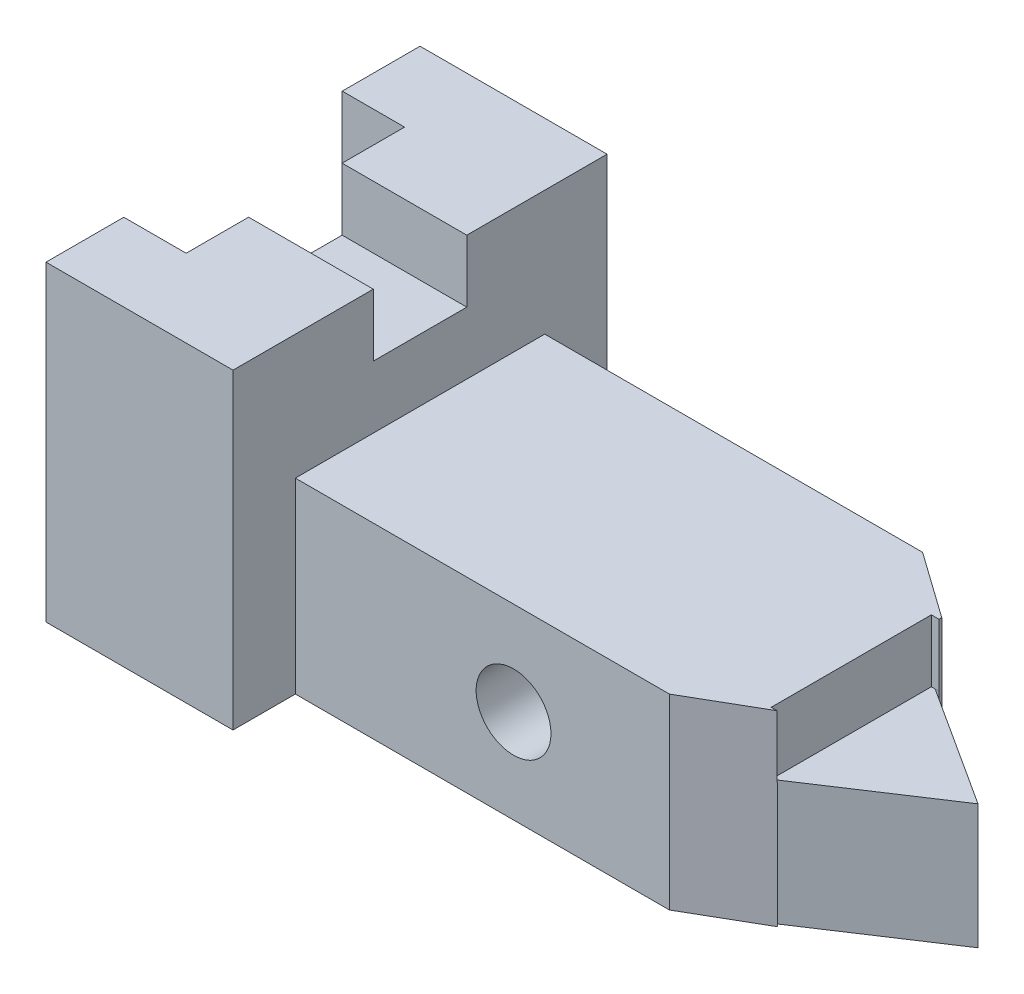
ISO-10303-21;
HEADER;
FILE_DESCRIPTION(('STEP AP214'),'2;1');
FILE_NAME('part.step','',(''),(''),'','','');
FILE_SCHEMA(('AUTOMOTIVE_DESIGN { 1 0 10303 214 1 1 1 1 }'));
ENDSEC;
DATA;
#1=APPLICATION_CONTEXT('core data for automotive mechanical design processes');
#2=APPLICATION_PROTOCOL_DEFINITION('international standard','automotive_design',2000,#1);
#3=PRODUCT_CONTEXT('',#1,'mechanical');
#4=PRODUCT('Part','Part','',(#3));
#5=PRODUCT_RELATED_PRODUCT_CATEGORY('part','',(#4));
#6=PRODUCT_DEFINITION_FORMATION('','',#4);
#7=PRODUCT_DEFINITION_CONTEXT('part definition',#1,'design');
#8=PRODUCT_DEFINITION('design','',#6,#7);
#9=PRODUCT_DEFINITION_SHAPE('','',#8);
#10=(LENGTH_UNIT() NAMED_UNIT(*) SI_UNIT(.MILLI.,.METRE.));
#11=(NAMED_UNIT(*) PLANE_ANGLE_UNIT() SI_UNIT($,.RADIAN.));
#12=(NAMED_UNIT(*) SI_UNIT($,.STERADIAN.) SOLID_ANGLE_UNIT());
#13=UNCERTAINTY_MEASURE_WITH_UNIT(LENGTH_MEASURE(1.E-05),#10,'distance_accuracy_value','');
#14=(GEOMETRIC_REPRESENTATION_CONTEXT(3) GLOBAL_UNCERTAINTY_ASSIGNED_CONTEXT((#13)) GLOBAL_UNIT_ASSIGNED_CONTEXT((#10,
#11,#12)) REPRESENTATION_CONTEXT('',''));
#15=CARTESIAN_POINT('',(0.,0.,0.));
#16=DIRECTION('',(0.,0.,1.));
#17=DIRECTION('',(1.,0.,0.));
#18=AXIS2_PLACEMENT_3D('',#15,#16,#17);
#19=CARTESIAN_POINT('',(-21.8340611353712,-16.8122270742358,-60.));
#20=DIRECTION('',(-1.,0.,0.));
#21=DIRECTION('',(0.,0.,1.));
#22=AXIS2_PLACEMENT_3D('',#19,#20,#21);
#23=PLANE('',#22);
#24=DIRECTION('',(0.,1.,0.));
#25=VECTOR('',#24,1.);
#26=CARTESIAN_POINT('',(-21.8340611353712,-36.8122270742358,-12.4803423104678));
#27=LINE('',#26,#25);
#28=CARTESIAN_POINT('',(-21.8340611353712,-16.8122270742358,-12.4803423104678));
#29=VERTEX_POINT('',#28);
#30=CARTESIAN_POINT('',(-21.8340611353712,33.1877729257642,-12.4803423104678));
#31=VERTEX_POINT('',#30);
#32=EDGE_CURVE('E230',#29,#31,#27,.T.);
#33=ORIENTED_EDGE('',*,*,#32,.F.);
#34=DIRECTION('',(0.,0.,1.));
#35=VECTOR('',#34,1.);
#36=CARTESIAN_POINT('',(-21.8340611353712,-16.8122270742358,-60.));
#37=LINE('',#36,#35);
#38=CARTESIAN_POINT('',(-21.8340611353712,-16.8122270742358,0.));
#39=VERTEX_POINT('',#38);
#40=EDGE_CURVE('E448',#29,#39,#37,.T.);
#41=ORIENTED_EDGE('',*,*,#40,.T.);
#42=DIRECTION('',(0.,-1.,0.));
#43=VECTOR('',#42,1.);
#44=CARTESIAN_POINT('',(-21.8340611353712,-16.8122270742358,0.));
#45=LINE('',#44,#43);
#46=CARTESIAN_POINT('',(-21.8340611353712,33.1877729257642,0.));
#47=VERTEX_POINT('',#46);
#48=EDGE_CURVE('E430',#47,#39,#45,.T.);
#49=ORIENTED_EDGE('',*,*,#48,.F.);
#50=DIRECTION('',(0.,0.,1.));
#51=VECTOR('',#50,1.);
#52=CARTESIAN_POINT('',(-21.8340611353712,33.1877729257642,-60.));
#53=LINE('',#52,#51);
#54=EDGE_CURVE('E468',#31,#47,#53,.T.);
#55=ORIENTED_EDGE('',*,*,#54,.F.);
#56=EDGE_LOOP('',(#33,#41,#49,#55));
#57=FACE_BOUND('',#56,.T.);
#58=ADVANCED_FACE('F39',(#57),#23,.T.);
#59=CARTESIAN_POINT('',(-21.8340611353712,33.1877729257642,-60.));
#60=DIRECTION('',(0.,1.,0.));
#61=DIRECTION('',(-1.,0.,0.));
#62=AXIS2_PLACEMENT_3D('',#59,#60,#61);
#63=PLANE('',#62);
#64=DIRECTION('',(1.,0.,0.));
#65=VECTOR('',#64,1.);
#66=CARTESIAN_POINT('',(-11.8340611353712,33.1877729257642,-12.4803423104678));
#67=LINE('',#66,#65);
#68=CARTESIAN_POINT('',(-11.8340611353712,33.1877729257642,-12.4803423104678));
#69=VERTEX_POINT('',#68);
#70=EDGE_CURVE('E227',#31,#69,#67,.T.);
#71=ORIENTED_EDGE('',*,*,#70,.F.);
#72=ORIENTED_EDGE('',*,*,#54,.T.);
#73=DIRECTION('',(-1.,0.,0.));
#74=VECTOR('',#73,1.);
#75=CARTESIAN_POINT('',(-21.8340611353712,33.1877729257642,0.));
#76=LINE('',#75,#74);
#77=CARTESIAN_POINT('',(8.16593886462882,33.1877729257642,0.));
#78=VERTEX_POINT('',#77);
#79=EDGE_CURVE('E436',#78,#47,#76,.T.);
#80=ORIENTED_EDGE('',*,*,#79,.F.);
#81=DIRECTION('',(0.,0.,1.));
#82=VECTOR('',#81,1.);
#83=CARTESIAN_POINT('',(8.16593886462882,33.1877729257642,-60.));
#84=LINE('',#83,#82);
#85=CARTESIAN_POINT('',(8.16593886462882,33.1877729257642,-22.5));
#86=VERTEX_POINT('',#85);
#87=EDGE_CURVE('E473',#86,#78,#84,.T.);
#88=ORIENTED_EDGE('',*,*,#87,.F.);
#89=DIRECTION('',(-1.,0.,0.));
#90=VECTOR('',#89,1.);
#91=CARTESIAN_POINT('',(0.,33.1877729257642,-22.5));
#92=LINE('',#91,#90);
#93=CARTESIAN_POINT('',(-11.8340611353712,33.1877729257642,-22.5));
#94=VERTEX_POINT('',#93);
#95=EDGE_CURVE('E239',#86,#94,#92,.T.);
#96=ORIENTED_EDGE('',*,*,#95,.T.);
#97=DIRECTION('',(0.,0.,-1.));
#98=VECTOR('',#97,1.);
#99=CARTESIAN_POINT('',(-11.8340611353712,33.1877729257642,-47.5196576895322));
#100=LINE('',#99,#98);
#101=EDGE_CURVE('E215',#69,#94,#100,.T.);
#102=ORIENTED_EDGE('',*,*,#101,.F.);
#103=EDGE_LOOP('',(#71,#72,#80,#88,#96,#102));
#104=FACE_BOUND('',#103,.T.);
#105=ADVANCED_FACE('F237',(#104),#63,.T.);
#106=CARTESIAN_POINT('',(78.1659388646288,3.18777292576419,-16.3243930873946));
#107=DIRECTION('',(0.,-1.,0.));
#108=DIRECTION('',(0.,0.,-1.));
#109=AXIS2_PLACEMENT_3D('',#106,#107,#108);
#110=PLANE('',#109);
#111=DIRECTION('',(0.999999826050975,0.,0.000589828805581013));
#112=VECTOR('',#111,1.);
#113=CARTESIAN_POINT('',(0.0248069572609484,3.18777292576419,-42.0578864766806));
#114=LINE('',#113,#112);
#115=CARTESIAN_POINT('',(78.7775995276505,3.18777292576419,-42.0114358030226));
#116=VERTEX_POINT('',#115);
#117=CARTESIAN_POINT('',(79.389260190672,3.18777292576419,-42.0110750278815));
#118=VERTEX_POINT('',#117);
#119=EDGE_CURVE('E285',#116,#118,#114,.T.);
#120=ORIENTED_EDGE('',*,*,#119,.T.);
#121=DIRECTION('',(0.,0.,-1.));
#122=VECTOR('',#121,1.);
#123=CARTESIAN_POINT('',(79.389260190672,3.18777292576419,-16.3243930873946));
#124=LINE('',#123,#122);
#125=CARTESIAN_POINT('',(79.389260190672,3.18777292576419,-42.0114358030226));
#126=VERTEX_POINT('',#125);
#127=EDGE_CURVE('E339',#118,#126,#124,.T.);
#128=ORIENTED_EDGE('',*,*,#127,.T.);
#129=DIRECTION('',(1.,0.,0.));
#130=VECTOR('',#129,1.);
#131=CARTESIAN_POINT('',(78.1659388646288,3.18777292576419,-42.0114358030226));
#132=LINE('',#131,#130);
#133=EDGE_CURVE('E374',#116,#126,#132,.T.);
#134=ORIENTED_EDGE('',*,*,#133,.F.);
#135=EDGE_LOOP('',(#120,#128,#134));
#136=FACE_BOUND('',#135,.T.);
#137=ADVANCED_FACE('F512',(#136),#110,.F.);
#138=CARTESIAN_POINT('',(-21.8340611353712,-16.8122270742358,-60.));
#139=DIRECTION('',(0.,-1.,0.));
#140=DIRECTION('',(0.,0.,-1.));
#141=AXIS2_PLACEMENT_3D('',#138,#139,#140);
#142=PLANE('',#141);
#143=DIRECTION('',(-1.,0.,0.));
#144=VECTOR('',#143,1.);
#145=CARTESIAN_POINT('',(-21.8340611353712,-16.8122270742358,-12.4803423104678));
#146=LINE('',#145,#144);
#147=CARTESIAN_POINT('',(-11.8340611353712,-16.8122270742358,-12.4803423104678));
#148=VERTEX_POINT('',#147);
#149=EDGE_CURVE('E260',#148,#29,#146,.T.);
#150=ORIENTED_EDGE('',*,*,#149,.F.);
#151=DIRECTION('',(0.,0.,1.));
#152=VECTOR('',#151,1.);
#153=CARTESIAN_POINT('',(-11.8340611353712,-16.8122270742358,-60.));
#154=LINE('',#153,#152);
#155=CARTESIAN_POINT('',(-11.8340611353712,-16.8122270742358,-47.5196576895322));
#156=VERTEX_POINT('',#155);
#157=EDGE_CURVE('E219',#156,#148,#154,.T.);
#158=ORIENTED_EDGE('',*,*,#157,.F.);
#159=DIRECTION('',(1.,0.,0.));
#160=VECTOR('',#159,1.);
#161=CARTESIAN_POINT('',(-21.8340611353712,-16.8122270742358,-47.5196576895322));
#162=LINE('',#161,#160);
#163=CARTESIAN_POINT('',(-21.8340611353712,-16.8122270742358,-47.5196576895322));
#164=VERTEX_POINT('',#163);
#165=EDGE_CURVE('E257',#164,#156,#162,.T.);
#166=ORIENTED_EDGE('',*,*,#165,.F.);
#167=CARTESIAN_POINT('',(-21.8340611353712,-16.8122270742358,-60.));
#168=VERTEX_POINT('',#167);
#169=EDGE_CURVE('E479',#168,#164,#37,.T.);
#170=ORIENTED_EDGE('',*,*,#169,.F.);
#171=DIRECTION('',(1.,0.,0.));
#172=VECTOR('',#171,1.);
#173=CARTESIAN_POINT('',(-21.8340611353712,-16.8122270742358,-60.));
#174=LINE('',#173,#172);
#175=CARTESIAN_POINT('',(8.16593886462882,-16.8122270742358,-60.));
#176=VERTEX_POINT('',#175);
#177=EDGE_CURVE('E435',#168,#176,#174,.T.);
#178=ORIENTED_EDGE('',*,*,#177,.T.);
#179=DIRECTION('',(0.,0.,1.));
#180=VECTOR('',#179,1.);
#181=CARTESIAN_POINT('',(8.16593886462882,-16.8122270742358,-60.));
#182=LINE('',#181,#180);
#183=CARTESIAN_POINT('',(8.16593886462882,-16.8122270742358,-50.));
#184=VERTEX_POINT('',#183);
#185=EDGE_CURVE('E474',#176,#184,#182,.T.);
#186=ORIENTED_EDGE('',*,*,#185,.T.);
#187=DIRECTION('',(-1.,0.,0.));
#188=VECTOR('',#187,1.);
#189=CARTESIAN_POINT('',(98.1659388646288,-16.8122270742358,-50.));
#190=LINE('',#189,#188);
#191=CARTESIAN_POINT('',(68.7775995276504,-16.8122270742358,-50.));
#192=VERTEX_POINT('',#191);
#193=EDGE_CURVE('E424',#192,#184,#190,.T.);
#194=ORIENTED_EDGE('',*,*,#193,.F.);
#195=DIRECTION('',(-0.815286839488451,0.,-0.579057310943341));
#196=VECTOR('',#195,1.);
#197=CARTESIAN_POINT('',(3.8277183853929,-16.8122270742358,-96.1306397928897));
#198=LINE('',#197,#196);
#199=CARTESIAN_POINT('',(79.389260190672,-16.8122270742358,-42.463070185178));
#200=VERTEX_POINT('',#199);
#201=EDGE_CURVE('E398',#200,#192,#198,.T.);
#202=ORIENTED_EDGE('',*,*,#201,.F.);
#203=DIRECTION('',(0.,0.,-1.));
#204=VECTOR('',#203,1.);
#205=CARTESIAN_POINT('',(79.389260190672,-16.8122270742358,-42.));
#206=LINE('',#205,#204);
#207=CARTESIAN_POINT('',(79.389260190672,-16.8122270742358,-42.0110750278815));
#208=VERTEX_POINT('',#207);
#209=EDGE_CURVE('E336',#208,#200,#206,.T.);
#210=ORIENTED_EDGE('',*,*,#209,.F.);
#211=DIRECTION('',(-0.999999826050975,0.,-0.000589828805581013));
#212=VECTOR('',#211,1.);
#213=CARTESIAN_POINT('',(-21.8446363042624,-16.8122270742358,-42.0707857065221));
#214=LINE('',#213,#212);
#215=CARTESIAN_POINT('',(78.7775995276505,-16.8122270742358,-42.0114358030226));
#216=VERTEX_POINT('',#215);
#217=EDGE_CURVE('E307',#208,#216,#214,.T.);
#218=ORIENTED_EDGE('',*,*,#217,.T.);
#219=DIRECTION('',(-0.840240777547195,0.,-0.542213459577393));
#220=VECTOR('',#219,1.);
#221=CARTESIAN_POINT('',(-0.450099541336825,-16.8122270742358,-93.1376438549036));
#222=LINE('',#221,#220);
#223=CARTESIAN_POINT('',(98.1659388646288,-16.8122270742358,-29.5));
#224=VERTEX_POINT('',#223);
#225=EDGE_CURVE('E304',#224,#216,#222,.T.);
#226=ORIENTED_EDGE('',*,*,#225,.F.);
#227=DIRECTION('',(0.835077350902561,0.,-0.550132545855598));
#228=VECTOR('',#227,1.);
#229=CARTESIAN_POINT('',(28.4952355114466,-16.8122270742358,16.3976900353133));
#230=LINE('',#229,#228);
#231=CARTESIAN_POINT('',(78.1659388646288,-16.8122270742358,-16.3243930873946));
#232=VERTEX_POINT('',#231);
#233=EDGE_CURVE('E332',#232,#224,#230,.T.);
#234=ORIENTED_EDGE('',*,*,#233,.F.);
#235=DIRECTION('',(-0.999429931961685,0.,0.033761088534901));
#236=VECTOR('',#235,1.);
#237=CARTESIAN_POINT('',(-20.2463845795361,-16.8122270742358,-12.999990787173));
#238=LINE('',#237,#236);
#239=CARTESIAN_POINT('',(79.1794062615942,-16.8122270742358,-16.3586283663491));
#240=VERTEX_POINT('',#239);
#241=EDGE_CURVE('E322',#240,#232,#238,.T.);
#242=ORIENTED_EDGE('',*,*,#241,.F.);
#243=DIRECTION('',(0.866025403784438,0.,-0.500000000000001));
#244=VECTOR('',#243,1.);
#245=CARTESIAN_POINT('',(22.3165739592399,-16.8122270742358,16.4711431702997));
#246=LINE('',#245,#244);
#247=CARTESIAN_POINT('',(68.1659388646288,-16.8122270742358,-10.));
#248=VERTEX_POINT('',#247);
#249=EDGE_CURVE('E387',#248,#240,#246,.T.);
#250=ORIENTED_EDGE('',*,*,#249,.F.);
#251=DIRECTION('',(-1.,0.,0.));
#252=VECTOR('',#251,1.);
#253=CARTESIAN_POINT('',(98.1659388646288,-16.8122270742358,-10.));
#254=LINE('',#253,#252);
#255=CARTESIAN_POINT('',(8.16593886462882,-16.8122270742358,-10.));
#256=VERTEX_POINT('',#255);
#257=EDGE_CURVE('E427',#248,#256,#254,.T.);
#258=ORIENTED_EDGE('',*,*,#257,.T.);
#259=CARTESIAN_POINT('',(8.16593886462882,-16.8122270742358,0.));
#260=VERTEX_POINT('',#259);
#261=EDGE_CURVE('E478',#256,#260,#182,.T.);
#262=ORIENTED_EDGE('',*,*,#261,.T.);
#263=DIRECTION('',(1.,0.,0.));
#264=VECTOR('',#263,1.);
#265=CARTESIAN_POINT('',(-21.8340611353712,-16.8122270742358,0.));
#266=LINE('',#265,#264);
#267=EDGE_CURVE('E452',#39,#260,#266,.T.);
#268=ORIENTED_EDGE('',*,*,#267,.F.);
#269=ORIENTED_EDGE('',*,*,#40,.F.);
#270=EDGE_LOOP('',(#150,#158,#166,#170,#178,#186,#194,#202,#210,#218,#226,#234,#242,#250,#258,
#262,#268,#269));
#271=FACE_BOUND('',#270,.T.);
#272=ADVANCED_FACE('F547',(#271),#142,.T.);
#273=CARTESIAN_POINT('',(79.389260190672,13.1877729257642,-42.));
#274=DIRECTION('',(-1.,0.,0.));
#275=DIRECTION('',(0.,0.,1.));
#276=AXIS2_PLACEMENT_3D('',#273,#274,#275);
#277=PLANE('',#276);
#278=DIRECTION('',(0.,1.,0.));
#279=VECTOR('',#278,1.);
#280=CARTESIAN_POINT('',(79.389260190672,13.1877729257642,-42.0110750278815));
#281=LINE('',#280,#279);
#282=EDGE_CURVE('E11',#208,#118,#281,.T.);
#283=ORIENTED_EDGE('',*,*,#282,.F.);
#284=ORIENTED_EDGE('',*,*,#209,.T.);
#285=DIRECTION('',(0.,1.,0.));
#286=VECTOR('',#285,1.);
#287=CARTESIAN_POINT('',(79.389260190672,-76.8122270742358,-42.463070185178));
#288=LINE('',#287,#286);
#289=CARTESIAN_POINT('',(79.389260190672,13.1877729257642,-42.463070185178));
#290=VERTEX_POINT('',#289);
#291=EDGE_CURVE('E384',#200,#290,#288,.T.);
#292=ORIENTED_EDGE('',*,*,#291,.T.);
#293=DIRECTION('',(0.,0.,-1.));
#294=VECTOR('',#293,1.);
#295=CARTESIAN_POINT('',(79.389260190672,13.1877729257642,-42.));
#296=LINE('',#295,#294);
#297=CARTESIAN_POINT('',(79.389260190672,13.1877729257642,-42.0114358030226));
#298=VERTEX_POINT('',#297);
#299=EDGE_CURVE('E63',#298,#290,#296,.T.);
#300=ORIENTED_EDGE('',*,*,#299,.F.);
#301=DIRECTION('',(0.,1.,0.));
#302=VECTOR('',#301,1.);
#303=CARTESIAN_POINT('',(79.389260190672,13.1877729257642,-42.0114358030226));
#304=LINE('',#303,#302);
#305=EDGE_CURVE('E48',#126,#298,#304,.T.);
#306=ORIENTED_EDGE('',*,*,#305,.F.);
#307=ORIENTED_EDGE('',*,*,#127,.F.);
#308=EDGE_LOOP('',(#283,#284,#292,#300,#306,#307));
#309=FACE_BOUND('',#308,.T.);
#310=ADVANCED_FACE('F591',(#309),#277,.F.);
#311=DIRECTION('',(-0.835077350902561,0.,0.550132545855598));
#312=VECTOR('',#311,1.);
#313=CARTESIAN_POINT('',(16.1571156117301,3.18777292576419,24.5258009272762));
#314=LINE('',#313,#312);
#315=CARTESIAN_POINT('',(98.1659388646288,3.18777292576419,-29.5));
#316=VERTEX_POINT('',#315);
#317=CARTESIAN_POINT('',(78.1659388646288,3.18777292576419,-16.3243930873946));
#318=VERTEX_POINT('',#317);
#319=EDGE_CURVE('E311',#316,#318,#314,.T.);
#320=ORIENTED_EDGE('',*,*,#319,.F.);
#321=DIRECTION('',(0.840240777547195,0.,0.542213459577393));
#322=VECTOR('',#321,1.);
#323=CARTESIAN_POINT('',(42.3002388087286,3.18777292576419,-65.5505408788271));
#324=LINE('',#323,#322);
#325=EDGE_CURVE('E298',#116,#316,#324,.T.);
#326=ORIENTED_EDGE('',*,*,#325,.F.);
#327=CARTESIAN_POINT('',(78.1659388646288,3.18777292576419,-42.0114358030226));
#328=VERTEX_POINT('',#327);
#329=EDGE_CURVE('E370',#328,#116,#132,.T.);
#330=ORIENTED_EDGE('',*,*,#329,.F.);
#331=DIRECTION('',(0.,0.,-1.));
#332=VECTOR('',#331,1.);
#333=CARTESIAN_POINT('',(78.1659388646288,3.18777292576419,-16.3243930873946));
#334=LINE('',#333,#332);
#335=EDGE_CURVE('E349',#318,#328,#334,.T.);
#336=ORIENTED_EDGE('',*,*,#335,.F.);
#337=EDGE_LOOP('',(#320,#326,#330,#336));
#338=FACE_BOUND('',#337,.T.);
#339=ADVANCED_FACE('F509',(#338),#110,.F.);
#340=CARTESIAN_POINT('',(98.1659388646288,13.1877729257642,-10.));
#341=DIRECTION('',(0.,-1.,0.));
#342=DIRECTION('',(0.,0.,-1.));
#343=AXIS2_PLACEMENT_3D('',#340,#341,#342);
#344=PLANE('',#343);
#345=DIRECTION('',(1.,0.,0.));
#346=VECTOR('',#345,1.);
#347=CARTESIAN_POINT('',(78.1659388646288,13.1877729257642,-42.0114358030226));
#348=LINE('',#347,#346);
#349=CARTESIAN_POINT('',(78.1659388646288,13.1877729257642,-42.0114358030226));
#350=VERTEX_POINT('',#349);
#351=EDGE_CURVE('E366',#350,#298,#348,.T.);
#352=ORIENTED_EDGE('',*,*,#351,.T.);
#353=ORIENTED_EDGE('',*,*,#299,.T.);
#354=DIRECTION('',(0.815286839488451,0.,0.579057310943341));
#355=VECTOR('',#354,1.);
#356=CARTESIAN_POINT('',(46.666526214385,13.1877729257642,-65.7043852969393));
#357=LINE('',#356,#355);
#358=CARTESIAN_POINT('',(68.7775995276504,13.1877729257642,-50.));
#359=VERTEX_POINT('',#358);
#360=EDGE_CURVE('E378',#359,#290,#357,.T.);
#361=ORIENTED_EDGE('',*,*,#360,.F.);
#362=DIRECTION('',(-1.,0.,0.));
#363=VECTOR('',#362,1.);
#364=CARTESIAN_POINT('',(98.1659388646288,13.1877729257642,-50.));
#365=LINE('',#364,#363);
#366=CARTESIAN_POINT('',(8.16593886462882,13.1877729257642,-50.));
#367=VERTEX_POINT('',#366);
#368=EDGE_CURVE('E421',#359,#367,#365,.T.);
#369=ORIENTED_EDGE('',*,*,#368,.T.);
#370=DIRECTION('',(0.,0.,1.));
#371=VECTOR('',#370,1.);
#372=CARTESIAN_POINT('',(8.16593886462882,13.1877729257642,-10.));
#373=LINE('',#372,#371);
#374=CARTESIAN_POINT('',(8.16593886462882,13.1877729257642,-10.));
#375=VERTEX_POINT('',#374);
#376=EDGE_CURVE('E414',#367,#375,#373,.T.);
#377=ORIENTED_EDGE('',*,*,#376,.T.);
#378=DIRECTION('',(-1.,0.,0.));
#379=VECTOR('',#378,1.);
#380=CARTESIAN_POINT('',(98.1659388646288,13.1877729257642,-10.));
#381=LINE('',#380,#379);
#382=CARTESIAN_POINT('',(68.1659388646288,13.1877729257642,-10.));
#383=VERTEX_POINT('',#382);
#384=EDGE_CURVE('E418',#383,#375,#381,.T.);
#385=ORIENTED_EDGE('',*,*,#384,.F.);
#386=DIRECTION('',(-0.866025403784438,0.,0.500000000000001));
#387=VECTOR('',#386,1.);
#388=CARTESIAN_POINT('',(79.389260190672,13.1877729257642,-16.4797875887927));
#389=LINE('',#388,#387);
#390=CARTESIAN_POINT('',(79.1201090190337,13.1877729257642,-16.3243930873946));
#391=VERTEX_POINT('',#390);
#392=EDGE_CURVE('E383',#391,#383,#389,.T.);
#393=ORIENTED_EDGE('',*,*,#392,.F.);
#394=DIRECTION('',(1.,0.,0.));
#395=VECTOR('',#394,1.);
#396=CARTESIAN_POINT('',(78.1659388646288,13.1877729257642,-16.3243930873946));
#397=LINE('',#396,#395);
#398=CARTESIAN_POINT('',(78.1659388646288,13.1877729257642,-16.3243930873946));
#399=VERTEX_POINT('',#398);
#400=EDGE_CURVE('E362',#399,#391,#397,.T.);
#401=ORIENTED_EDGE('',*,*,#400,.F.);
#402=DIRECTION('',(0.,0.,1.));
#403=VECTOR('',#402,1.);
#404=CARTESIAN_POINT('',(78.1659388646288,13.1877729257642,-16.3243930873946));
#405=LINE('',#404,#403);
#406=EDGE_CURVE('E357',#350,#399,#405,.T.);
#407=ORIENTED_EDGE('',*,*,#406,.F.);
#408=EDGE_LOOP('',(#352,#353,#361,#369,#377,#385,#393,#401,#407));
#409=FACE_BOUND('',#408,.T.);
#410=ADVANCED_FACE('F499',(#409),#344,.F.);
#411=DIRECTION('',(0.,1.,0.));
#412=VECTOR('',#411,1.);
#413=CARTESIAN_POINT('',(-21.8340611353712,-36.8122270742358,-47.5196576895322));
#414=LINE('',#413,#412);
#415=CARTESIAN_POINT('',(-21.8340611353712,33.1877729257642,-47.5196576895322));
#416=VERTEX_POINT('',#415);
#417=EDGE_CURVE('E249',#164,#416,#414,.T.);
#418=ORIENTED_EDGE('',*,*,#417,.T.);
#419=CARTESIAN_POINT('',(-21.8340611353712,33.1877729257642,-60.));
#420=VERTEX_POINT('',#419);
#421=EDGE_CURVE('E463',#420,#416,#53,.T.);
#422=ORIENTED_EDGE('',*,*,#421,.F.);
#423=DIRECTION('',(0.,-1.,0.));
#424=VECTOR('',#423,1.);
#425=CARTESIAN_POINT('',(-21.8340611353712,-16.8122270742358,-60.));
#426=LINE('',#425,#424);
#427=EDGE_CURVE('E431',#420,#168,#426,.T.);
#428=ORIENTED_EDGE('',*,*,#427,.T.);
#429=ORIENTED_EDGE('',*,*,#169,.T.);
#430=EDGE_LOOP('',(#418,#422,#428,#429));
#431=FACE_BOUND('',#430,.T.);
#432=ADVANCED_FACE('F41',(#431),#23,.T.);
#433=DIRECTION('',(-1.,0.,0.));
#434=VECTOR('',#433,1.);
#435=CARTESIAN_POINT('',(-21.8340611353712,33.1877729257642,-47.5196576895322));
#436=LINE('',#435,#434);
#437=CARTESIAN_POINT('',(-11.8340611353712,33.1877729257642,-47.5196576895322));
#438=VERTEX_POINT('',#437);
#439=EDGE_CURVE('E224',#438,#416,#436,.T.);
#440=ORIENTED_EDGE('',*,*,#439,.F.);
#441=CARTESIAN_POINT('',(-11.8340611353712,33.1877729257642,-37.5));
#442=VERTEX_POINT('',#441);
#443=EDGE_CURVE('E234',#442,#438,#100,.T.);
#444=ORIENTED_EDGE('',*,*,#443,.F.);
#445=DIRECTION('',(-1.,0.,0.));
#446=VECTOR('',#445,1.);
#447=CARTESIAN_POINT('',(0.,33.1877729257642,-37.5));
#448=LINE('',#447,#446);
#449=CARTESIAN_POINT('',(8.16593886462882,33.1877729257642,-37.5));
#450=VERTEX_POINT('',#449);
#451=EDGE_CURVE('E263',#450,#442,#448,.T.);
#452=ORIENTED_EDGE('',*,*,#451,.F.);
#453=CARTESIAN_POINT('',(8.16593886462882,33.1877729257642,-60.));
#454=VERTEX_POINT('',#453);
#455=EDGE_CURVE('E469',#454,#450,#84,.T.);
#456=ORIENTED_EDGE('',*,*,#455,.F.);
#457=DIRECTION('',(-1.,0.,0.));
#458=VECTOR('',#457,1.);
#459=CARTESIAN_POINT('',(-21.8340611353712,33.1877729257642,-60.));
#460=LINE('',#459,#458);
#461=EDGE_CURVE('E444',#454,#420,#460,.T.);
#462=ORIENTED_EDGE('',*,*,#461,.T.);
#463=ORIENTED_EDGE('',*,*,#421,.T.);
#464=EDGE_LOOP('',(#440,#444,#452,#456,#462,#463));
#465=FACE_BOUND('',#464,.T.);
#466=ADVANCED_FACE('F543',(#465),#63,.T.);
#467=CARTESIAN_POINT('',(8.16593886462882,-16.8122270742358,-60.));
#468=DIRECTION('',(1.,0.,0.));
#469=DIRECTION('',(0.,0.,-1.));
#470=AXIS2_PLACEMENT_3D('',#467,#468,#469);
#471=PLANE('',#470);
#472=DIRECTION('',(0.,1.,0.));
#473=VECTOR('',#472,1.);
#474=CARTESIAN_POINT('',(8.16593886462882,23.1877729257642,-37.5));
#475=LINE('',#474,#473);
#476=CARTESIAN_POINT('',(8.16593886462882,23.1877729257642,-37.5));
#477=VERTEX_POINT('',#476);
#478=EDGE_CURVE('E282',#477,#450,#475,.T.);
#479=ORIENTED_EDGE('',*,*,#478,.F.);
#480=DIRECTION('',(0.,0.,-1.));
#481=VECTOR('',#480,1.);
#482=CARTESIAN_POINT('',(8.16593886462882,23.1877729257642,0.));
#483=LINE('',#482,#481);
#484=CARTESIAN_POINT('',(8.16593886462882,23.1877729257642,-22.5));
#485=VERTEX_POINT('',#484);
#486=EDGE_CURVE('E273',#485,#477,#483,.T.);
#487=ORIENTED_EDGE('',*,*,#486,.F.);
#488=DIRECTION('',(0.,1.,0.));
#489=VECTOR('',#488,1.);
#490=CARTESIAN_POINT('',(8.16593886462882,23.1877729257642,-22.5));
#491=LINE('',#490,#489);
#492=EDGE_CURVE('E286',#485,#86,#491,.T.);
#493=ORIENTED_EDGE('',*,*,#492,.T.);
#494=ORIENTED_EDGE('',*,*,#87,.T.);
#495=DIRECTION('',(0.,1.,0.));
#496=VECTOR('',#495,1.);
#497=CARTESIAN_POINT('',(8.16593886462882,-16.8122270742358,0.));
#498=LINE('',#497,#496);
#499=EDGE_CURVE('E456',#260,#78,#498,.T.);
#500=ORIENTED_EDGE('',*,*,#499,.F.);
#501=ORIENTED_EDGE('',*,*,#261,.F.);
#502=DIRECTION('',(0.,-1.,0.));
#503=VECTOR('',#502,1.);
#504=CARTESIAN_POINT('',(8.16593886462882,13.1877729257642,-10.));
#505=LINE('',#504,#503);
#506=EDGE_CURVE('E406',#375,#256,#505,.T.);
#507=ORIENTED_EDGE('',*,*,#506,.F.);
#508=ORIENTED_EDGE('',*,*,#376,.F.);
#509=DIRECTION('',(0.,1.,0.));
#510=VECTOR('',#509,1.);
#511=CARTESIAN_POINT('',(8.16593886462882,13.1877729257642,-50.));
#512=LINE('',#511,#510);
#513=EDGE_CURVE('E410',#184,#367,#512,.T.);
#514=ORIENTED_EDGE('',*,*,#513,.F.);
#515=ORIENTED_EDGE('',*,*,#185,.F.);
#516=DIRECTION('',(0.,1.,0.));
#517=VECTOR('',#516,1.);
#518=CARTESIAN_POINT('',(8.16593886462882,-16.8122270742358,-60.));
#519=LINE('',#518,#517);
#520=EDGE_CURVE('E440',#176,#454,#519,.T.);
#521=ORIENTED_EDGE('',*,*,#520,.T.);
#522=ORIENTED_EDGE('',*,*,#455,.T.);
#523=EDGE_LOOP('',(#479,#487,#493,#494,#500,#501,#507,#508,#514,#515,#521,#522));
#524=FACE_BOUND('',#523,.T.);
#525=ADVANCED_FACE('F530',(#524),#471,.T.);
#526=CARTESIAN_POINT('',(0.,0.,-60.));
#527=DIRECTION('',(0.,0.,-1.));
#528=DIRECTION('',(-1.,0.,0.));
#529=AXIS2_PLACEMENT_3D('',#526,#527,#528);
#530=PLANE('',#529);
#531=ORIENTED_EDGE('',*,*,#427,.F.);
#532=ORIENTED_EDGE('',*,*,#461,.F.);
#533=ORIENTED_EDGE('',*,*,#520,.F.);
#534=ORIENTED_EDGE('',*,*,#177,.F.);
#535=EDGE_LOOP('',(#531,#532,#533,#534));
#536=FACE_BOUND('',#535,.T.);
#537=ADVANCED_FACE('F566',(#536),#530,.T.);
#538=CARTESIAN_POINT('',(0.,0.,0.));
#539=DIRECTION('',(0.,0.,-1.));
#540=DIRECTION('',(-1.,0.,0.));
#541=AXIS2_PLACEMENT_3D('',#538,#539,#540);
#542=PLANE('',#541);
#543=ORIENTED_EDGE('',*,*,#48,.T.);
#544=ORIENTED_EDGE('',*,*,#267,.T.);
#545=ORIENTED_EDGE('',*,*,#499,.T.);
#546=ORIENTED_EDGE('',*,*,#79,.T.);
#547=EDGE_LOOP('',(#543,#544,#545,#546));
#548=FACE_BOUND('',#547,.T.);
#549=ADVANCED_FACE('F525',(#548),#542,.F.);
#550=CARTESIAN_POINT('',(98.1659388646288,13.1877729257642,-10.));
#551=DIRECTION('',(0.,0.,-1.));
#552=DIRECTION('',(-1.,0.,0.));
#553=AXIS2_PLACEMENT_3D('',#550,#551,#552);
#554=PLANE('',#553);
#555=CARTESIAN_POINT('',(43.1659388646288,-1.81222707423581,-10.));
#556=DIRECTION('',(0.,0.,1.));
#557=DIRECTION('',(1.,0.,0.));
#558=AXIS2_PLACEMENT_3D('',#555,#556,#557);
#559=CIRCLE('',#558,5.99999999999999);
#560=CARTESIAN_POINT('',(49.1659388646288,-1.81222707423581,-10.));
#561=VERTEX_POINT('',#560);
#562=EDGE_CURVE('E401',#561,#561,#559,.T.);
#563=ORIENTED_EDGE('',*,*,#562,.F.);
#564=EDGE_LOOP('',(#563));
#565=FACE_BOUND('',#564,.T.);
#566=ORIENTED_EDGE('',*,*,#257,.F.);
#567=DIRECTION('',(0.,1.,0.));
#568=VECTOR('',#567,1.);
#569=CARTESIAN_POINT('',(68.1659388646288,-76.8122270742358,-10.));
#570=LINE('',#569,#568);
#571=EDGE_CURVE('E365',#248,#383,#570,.T.);
#572=ORIENTED_EDGE('',*,*,#571,.T.);
#573=ORIENTED_EDGE('',*,*,#384,.T.);
#574=ORIENTED_EDGE('',*,*,#506,.T.);
#575=EDGE_LOOP('',(#566,#572,#573,#574));
#576=FACE_BOUND('',#575,.T.);
#577=ADVANCED_FACE('F552',(#565,#576),#554,.F.);
#578=CARTESIAN_POINT('',(98.1659388646288,13.1877729257642,-50.));
#579=DIRECTION('',(0.,0.,1.));
#580=DIRECTION('',(1.,0.,0.));
#581=AXIS2_PLACEMENT_3D('',#578,#579,#580);
#582=PLANE('',#581);
#583=CARTESIAN_POINT('',(43.1659388646288,-1.81222707423581,-50.));
#584=DIRECTION('',(0.,0.,1.));
#585=DIRECTION('',(1.,0.,0.));
#586=AXIS2_PLACEMENT_3D('',#583,#584,#585);
#587=CIRCLE('',#586,5.99999999999999);
#588=CARTESIAN_POINT('',(49.1659388646288,-1.81222707423581,-50.));
#589=VERTEX_POINT('',#588);
#590=EDGE_CURVE('E405',#589,#589,#587,.T.);
#591=ORIENTED_EDGE('',*,*,#590,.T.);
#592=EDGE_LOOP('',(#591));
#593=FACE_BOUND('',#592,.T.);
#594=ORIENTED_EDGE('',*,*,#368,.F.);
#595=DIRECTION('',(0.,1.,0.));
#596=VECTOR('',#595,1.);
#597=CARTESIAN_POINT('',(68.7775995276504,-76.8122270742358,-50.));
#598=LINE('',#597,#596);
#599=EDGE_CURVE('E382',#192,#359,#598,.T.);
#600=ORIENTED_EDGE('',*,*,#599,.F.);
#601=ORIENTED_EDGE('',*,*,#193,.T.);
#602=ORIENTED_EDGE('',*,*,#513,.T.);
#603=EDGE_LOOP('',(#594,#600,#601,#602));
#604=FACE_BOUND('',#603,.T.);
#605=ADVANCED_FACE('F559',(#593,#604),#582,.F.);
#606=CARTESIAN_POINT('',(43.1659388646288,-1.81222707423581,-100.));
#607=DIRECTION('',(0.,0.,1.));
#608=DIRECTION('',(1.,0.,0.));
#609=AXIS2_PLACEMENT_3D('',#606,#607,#608);
#610=CYLINDRICAL_SURFACE('',#609,5.99999999999999);
#611=ORIENTED_EDGE('',*,*,#562,.T.);
#612=EDGE_LOOP('',(#611));
#613=FACE_BOUND('',#612,.T.);
#614=ORIENTED_EDGE('',*,*,#590,.F.);
#615=EDGE_LOOP('',(#614));
#616=FACE_BOUND('',#615,.T.);
#617=ADVANCED_FACE('F596',(#613,#616),#610,.F.);
#618=CARTESIAN_POINT('',(79.389260190672,-76.8122270742358,-16.4797875887927));
#619=DIRECTION('',(-0.500000000000001,0.,-0.866025403784438));
#620=DIRECTION('',(-0.866025403784438,0.,0.500000000000001));
#621=AXIS2_PLACEMENT_3D('',#618,#619,#620);
#622=PLANE('',#621);
#623=ORIENTED_EDGE('',*,*,#249,.T.);
#624=DIRECTION('',(0.,1.,0.));
#625=VECTOR('',#624,1.);
#626=CARTESIAN_POINT('',(79.1794062615942,-44.8122270742358,-16.3586283663491));
#627=LINE('',#626,#625);
#628=CARTESIAN_POINT('',(79.1794062615942,3.18777292576419,-16.3586283663491));
#629=VERTEX_POINT('',#628);
#630=EDGE_CURVE('E323',#240,#629,#627,.T.);
#631=ORIENTED_EDGE('',*,*,#630,.T.);
#632=DIRECTION('',(-0.866025403784438,0.,0.500000000000001));
#633=VECTOR('',#632,1.);
#634=CARTESIAN_POINT('',(79.389260190672,3.18777292576419,-16.4797875887927));
#635=LINE('',#634,#633);
#636=CARTESIAN_POINT('',(79.1201090190337,3.18777292576419,-16.3243930873946));
#637=VERTEX_POINT('',#636);
#638=EDGE_CURVE('E467',#629,#637,#635,.T.);
#639=ORIENTED_EDGE('',*,*,#638,.T.);
#640=DIRECTION('',(0.,1.,0.));
#641=VECTOR('',#640,1.);
#642=CARTESIAN_POINT('',(79.1201090190337,-76.8122270742358,-16.3243930873946));
#643=LINE('',#642,#641);
#644=EDGE_CURVE('E488',#637,#391,#643,.T.);
#645=ORIENTED_EDGE('',*,*,#644,.T.);
#646=ORIENTED_EDGE('',*,*,#392,.T.);
#647=ORIENTED_EDGE('',*,*,#571,.F.);
#648=EDGE_LOOP('',(#623,#631,#639,#645,#646,#647));
#649=FACE_BOUND('',#648,.T.);
#650=ADVANCED_FACE('F633',(#649),#622,.F.);
#651=CARTESIAN_POINT('',(46.666526214385,-76.8122270742358,-65.7043852969393));
#652=DIRECTION('',(-0.579057310943341,0.,0.815286839488451));
#653=DIRECTION('',(0.815286839488451,0.,0.579057310943341));
#654=AXIS2_PLACEMENT_3D('',#651,#652,#653);
#655=PLANE('',#654);
#656=ORIENTED_EDGE('',*,*,#201,.T.);
#657=ORIENTED_EDGE('',*,*,#599,.T.);
#658=ORIENTED_EDGE('',*,*,#360,.T.);
#659=ORIENTED_EDGE('',*,*,#291,.F.);
#660=EDGE_LOOP('',(#656,#657,#658,#659));
#661=FACE_BOUND('',#660,.T.);
#662=ADVANCED_FACE('F626',(#661),#655,.F.);
#663=CARTESIAN_POINT('',(78.1659388646288,13.1877729257642,-16.3243930873946));
#664=DIRECTION('',(0.,0.,1.));
#665=DIRECTION('',(1.,0.,0.));
#666=AXIS2_PLACEMENT_3D('',#663,#664,#665);
#667=PLANE('',#666);
#668=DIRECTION('',(1.,0.,0.));
#669=VECTOR('',#668,1.);
#670=CARTESIAN_POINT('',(78.1659388646288,3.18777292576419,-16.3243930873946));
#671=LINE('',#670,#669);
#672=EDGE_CURVE('E361',#318,#637,#671,.T.);
#673=ORIENTED_EDGE('',*,*,#672,.F.);
#674=DIRECTION('',(0.,-1.,0.));
#675=VECTOR('',#674,1.);
#676=CARTESIAN_POINT('',(78.1659388646288,13.1877729257642,-16.3243930873946));
#677=LINE('',#676,#675);
#678=EDGE_CURVE('E345',#399,#318,#677,.T.);
#679=ORIENTED_EDGE('',*,*,#678,.F.);
#680=ORIENTED_EDGE('',*,*,#400,.T.);
#681=ORIENTED_EDGE('',*,*,#644,.F.);
#682=EDGE_LOOP('',(#673,#679,#680,#681));
#683=FACE_BOUND('',#682,.T.);
#684=ADVANCED_FACE('F620',(#683),#667,.F.);
#685=ORIENTED_EDGE('',*,*,#638,.F.);
#686=DIRECTION('',(0.999429931961685,0.,-0.033761088534901));
#687=VECTOR('',#686,1.);
#688=CARTESIAN_POINT('',(-0.461720694427916,3.18777292576419,-13.6683235713907));
#689=LINE('',#688,#687);
#690=EDGE_CURVE('E314',#318,#629,#689,.T.);
#691=ORIENTED_EDGE('',*,*,#690,.F.);
#692=ORIENTED_EDGE('',*,*,#672,.T.);
#693=EDGE_LOOP('',(#685,#691,#692));
#694=FACE_BOUND('',#693,.T.);
#695=ADVANCED_FACE('F593',(#694),#110,.F.);
#696=CARTESIAN_POINT('',(78.1659388646288,13.1877729257642,-42.0114358030226));
#697=DIRECTION('',(0.,0.,-1.));
#698=DIRECTION('',(-1.,0.,0.));
#699=AXIS2_PLACEMENT_3D('',#696,#697,#698);
#700=PLANE('',#699);
#701=ORIENTED_EDGE('',*,*,#329,.T.);
#702=ORIENTED_EDGE('',*,*,#133,.T.);
#703=ORIENTED_EDGE('',*,*,#305,.T.);
#704=ORIENTED_EDGE('',*,*,#351,.F.);
#705=DIRECTION('',(0.,1.,0.));
#706=VECTOR('',#705,1.);
#707=CARTESIAN_POINT('',(78.1659388646288,13.1877729257642,-42.0114358030226));
#708=LINE('',#707,#706);
#709=EDGE_CURVE('E353',#328,#350,#708,.T.);
#710=ORIENTED_EDGE('',*,*,#709,.F.);
#711=EDGE_LOOP('',(#701,#702,#703,#704,#710));
#712=FACE_BOUND('',#711,.T.);
#713=ADVANCED_FACE('F493',(#712),#700,.F.);
#714=CARTESIAN_POINT('',(78.1659388646288,0.,0.));
#715=DIRECTION('',(1.,0.,0.));
#716=DIRECTION('',(0.,0.,-1.));
#717=AXIS2_PLACEMENT_3D('',#714,#715,#716);
#718=PLANE('',#717);
#719=ORIENTED_EDGE('',*,*,#678,.T.);
#720=ORIENTED_EDGE('',*,*,#335,.T.);
#721=ORIENTED_EDGE('',*,*,#709,.T.);
#722=ORIENTED_EDGE('',*,*,#406,.T.);
#723=EDGE_LOOP('',(#719,#720,#721,#722));
#724=FACE_BOUND('',#723,.T.);
#725=ADVANCED_FACE('F504',(#724),#718,.T.);
#726=CARTESIAN_POINT('',(16.1571156117301,-44.8122270742358,24.5258009272762));
#727=DIRECTION('',(-0.550132545855598,0.,-0.835077350902561));
#728=DIRECTION('',(-0.835077350902561,0.,0.550132545855598));
#729=AXIS2_PLACEMENT_3D('',#726,#727,#728);
#730=PLANE('',#729);
#731=ORIENTED_EDGE('',*,*,#233,.T.);
#732=DIRECTION('',(0.,1.,0.));
#733=VECTOR('',#732,1.);
#734=CARTESIAN_POINT('',(98.1659388646288,-44.8122270742358,-29.5));
#735=LINE('',#734,#733);
#736=EDGE_CURVE('E318',#224,#316,#735,.T.);
#737=ORIENTED_EDGE('',*,*,#736,.T.);
#738=ORIENTED_EDGE('',*,*,#319,.T.);
#739=DIRECTION('',(0.,1.,0.));
#740=VECTOR('',#739,1.);
#741=CARTESIAN_POINT('',(78.1659388646288,-44.8122270742358,-16.3243930873946));
#742=LINE('',#741,#740);
#743=EDGE_CURVE('E317',#232,#318,#742,.T.);
#744=ORIENTED_EDGE('',*,*,#743,.F.);
#745=EDGE_LOOP('',(#731,#737,#738,#744));
#746=FACE_BOUND('',#745,.T.);
#747=ADVANCED_FACE('F640',(#746),#730,.F.);
#748=CARTESIAN_POINT('',(-0.461720694427916,-44.8122270742358,-13.6683235713907));
#749=DIRECTION('',(0.033761088534901,0.,0.999429931961685));
#750=DIRECTION('',(0.999429931961685,0.,-0.033761088534901));
#751=AXIS2_PLACEMENT_3D('',#748,#749,#750);
#752=PLANE('',#751);
#753=ORIENTED_EDGE('',*,*,#241,.T.);
#754=ORIENTED_EDGE('',*,*,#743,.T.);
#755=ORIENTED_EDGE('',*,*,#690,.T.);
#756=ORIENTED_EDGE('',*,*,#630,.F.);
#757=EDGE_LOOP('',(#753,#754,#755,#756));
#758=FACE_BOUND('',#757,.T.);
#759=ADVANCED_FACE('F635',(#758),#752,.F.);
#760=CARTESIAN_POINT('',(0.0248069572609484,-44.8122270742358,-42.0578864766806));
#761=DIRECTION('',(-0.000589828805581013,0.,0.999999826050975));
#762=DIRECTION('',(0.999999826050975,0.,0.000589828805581013));
#763=AXIS2_PLACEMENT_3D('',#760,#761,#762);
#764=PLANE('',#763);
#765=ORIENTED_EDGE('',*,*,#282,.T.);
#766=ORIENTED_EDGE('',*,*,#119,.F.);
#767=DIRECTION('',(0.,1.,0.));
#768=VECTOR('',#767,1.);
#769=CARTESIAN_POINT('',(78.7775995276505,-44.8122270742358,-42.0114358030226));
#770=LINE('',#769,#768);
#771=EDGE_CURVE('E301',#216,#116,#770,.T.);
#772=ORIENTED_EDGE('',*,*,#771,.F.);
#773=ORIENTED_EDGE('',*,*,#217,.F.);
#774=EDGE_LOOP('',(#765,#766,#772,#773));
#775=FACE_BOUND('',#774,.T.);
#776=ADVANCED_FACE('F644',(#775),#764,.T.);
#777=CARTESIAN_POINT('',(42.3002388087286,-44.8122270742358,-65.5505408788271));
#778=DIRECTION('',(-0.542213459577393,0.,0.840240777547195));
#779=DIRECTION('',(0.840240777547195,0.,0.542213459577393));
#780=AXIS2_PLACEMENT_3D('',#777,#778,#779);
#781=PLANE('',#780);
#782=ORIENTED_EDGE('',*,*,#225,.T.);
#783=ORIENTED_EDGE('',*,*,#771,.T.);
#784=ORIENTED_EDGE('',*,*,#325,.T.);
#785=ORIENTED_EDGE('',*,*,#736,.F.);
#786=EDGE_LOOP('',(#782,#783,#784,#785));
#787=FACE_BOUND('',#786,.T.);
#788=ADVANCED_FACE('F641',(#787),#781,.F.);
#789=CARTESIAN_POINT('',(0.,23.1877729257642,-37.5));
#790=DIRECTION('',(0.,0.,-1.));
#791=DIRECTION('',(-1.,0.,0.));
#792=AXIS2_PLACEMENT_3D('',#789,#790,#791);
#793=PLANE('',#792);
#794=ORIENTED_EDGE('',*,*,#451,.T.);
#795=DIRECTION('',(0.,1.,0.));
#796=VECTOR('',#795,1.);
#797=CARTESIAN_POINT('',(-11.8340611353712,23.1877729257642,-37.5));
#798=LINE('',#797,#796);
#799=CARTESIAN_POINT('',(-11.8340611353712,23.1877729257642,-37.5));
#800=VERTEX_POINT('',#799);
#801=EDGE_CURVE('E276',#800,#442,#798,.T.);
#802=ORIENTED_EDGE('',*,*,#801,.F.);
#803=DIRECTION('',(-1.,0.,0.));
#804=VECTOR('',#803,1.);
#805=CARTESIAN_POINT('',(0.,23.1877729257642,-37.5));
#806=LINE('',#805,#804);
#807=EDGE_CURVE('E264',#477,#800,#806,.T.);
#808=ORIENTED_EDGE('',*,*,#807,.F.);
#809=ORIENTED_EDGE('',*,*,#478,.T.);
#810=EDGE_LOOP('',(#794,#802,#808,#809));
#811=FACE_BOUND('',#810,.T.);
#812=ADVANCED_FACE('F538',(#811),#793,.F.);
#813=CARTESIAN_POINT('',(0.,23.1877729257642,-22.5));
#814=DIRECTION('',(0.,0.,-1.));
#815=DIRECTION('',(-1.,0.,0.));
#816=AXIS2_PLACEMENT_3D('',#813,#814,#815);
#817=PLANE('',#816);
#818=ORIENTED_EDGE('',*,*,#95,.F.);
#819=ORIENTED_EDGE('',*,*,#492,.F.);
#820=DIRECTION('',(-1.,0.,0.));
#821=VECTOR('',#820,1.);
#822=CARTESIAN_POINT('',(0.,23.1877729257642,-22.5));
#823=LINE('',#822,#821);
#824=CARTESIAN_POINT('',(-11.8340611353712,23.1877729257642,-22.5));
#825=VERTEX_POINT('',#824);
#826=EDGE_CURVE('E55',#485,#825,#823,.T.);
#827=ORIENTED_EDGE('',*,*,#826,.T.);
#828=DIRECTION('',(0.,1.,0.));
#829=VECTOR('',#828,1.);
#830=CARTESIAN_POINT('',(-11.8340611353712,23.1877729257642,-22.5));
#831=LINE('',#830,#829);
#832=EDGE_CURVE('E290',#825,#94,#831,.T.);
#833=ORIENTED_EDGE('',*,*,#832,.T.);
#834=EDGE_LOOP('',(#818,#819,#827,#833));
#835=FACE_BOUND('',#834,.T.);
#836=ADVANCED_FACE('F534',(#835),#817,.T.);
#837=CARTESIAN_POINT('',(0.,23.1877729257642,0.));
#838=DIRECTION('',(0.,1.,0.));
#839=DIRECTION('',(-1.,0.,0.));
#840=AXIS2_PLACEMENT_3D('',#837,#838,#839);
#841=PLANE('',#840);
#842=ORIENTED_EDGE('',*,*,#807,.T.);
#843=DIRECTION('',(0.,0.,1.));
#844=VECTOR('',#843,1.);
#845=CARTESIAN_POINT('',(-11.8340611353712,23.1877729257642,0.));
#846=LINE('',#845,#844);
#847=EDGE_CURVE('E268',#800,#825,#846,.T.);
#848=ORIENTED_EDGE('',*,*,#847,.T.);
#849=ORIENTED_EDGE('',*,*,#826,.F.);
#850=ORIENTED_EDGE('',*,*,#486,.T.);
#851=EDGE_LOOP('',(#842,#848,#849,#850));
#852=FACE_BOUND('',#851,.T.);
#853=ADVANCED_FACE('F540',(#852),#841,.T.);
#854=CARTESIAN_POINT('',(-11.8340611353712,-36.8122270742358,-47.5196576895322));
#855=DIRECTION('',(1.,0.,0.));
#856=DIRECTION('',(0.,1.,0.));
#857=AXIS2_PLACEMENT_3D('',#854,#855,#856);
#858=PLANE('',#857);
#859=ORIENTED_EDGE('',*,*,#157,.T.);
#860=DIRECTION('',(0.,1.,0.));
#861=VECTOR('',#860,1.);
#862=CARTESIAN_POINT('',(-11.8340611353712,-36.8122270742358,-12.4803423104678));
#863=LINE('',#862,#861);
#864=EDGE_CURVE('E211',#148,#69,#863,.T.);
#865=ORIENTED_EDGE('',*,*,#864,.T.);
#866=ORIENTED_EDGE('',*,*,#101,.T.);
#867=ORIENTED_EDGE('',*,*,#832,.F.);
#868=ORIENTED_EDGE('',*,*,#847,.F.);
#869=ORIENTED_EDGE('',*,*,#801,.T.);
#870=ORIENTED_EDGE('',*,*,#443,.T.);
#871=DIRECTION('',(0.,1.,0.));
#872=VECTOR('',#871,1.);
#873=CARTESIAN_POINT('',(-11.8340611353712,-36.8122270742358,-47.5196576895322));
#874=LINE('',#873,#872);
#875=EDGE_CURVE('E223',#156,#438,#874,.T.);
#876=ORIENTED_EDGE('',*,*,#875,.F.);
#877=EDGE_LOOP('',(#859,#865,#866,#867,#868,#869,#870,#876));
#878=FACE_BOUND('',#877,.T.);
#879=ADVANCED_FACE('F213',(#878),#858,.F.);
#880=CARTESIAN_POINT('',(-11.8340611353712,-36.8122270742358,-12.4803423104678));
#881=DIRECTION('',(0.,0.,1.));
#882=DIRECTION('',(1.,0.,0.));
#883=AXIS2_PLACEMENT_3D('',#880,#881,#882);
#884=PLANE('',#883);
#885=ORIENTED_EDGE('',*,*,#149,.T.);
#886=ORIENTED_EDGE('',*,*,#32,.T.);
#887=ORIENTED_EDGE('',*,*,#70,.T.);
#888=ORIENTED_EDGE('',*,*,#864,.F.);
#889=EDGE_LOOP('',(#885,#886,#887,#888));
#890=FACE_BOUND('',#889,.T.);
#891=ADVANCED_FACE('F228',(#890),#884,.F.);
#892=CARTESIAN_POINT('',(-21.8340611353712,-36.8122270742358,-47.5196576895322));
#893=DIRECTION('',(0.,0.,-1.));
#894=DIRECTION('',(-1.,0.,0.));
#895=AXIS2_PLACEMENT_3D('',#892,#893,#894);
#896=PLANE('',#895);
#897=ORIENTED_EDGE('',*,*,#165,.T.);
#898=ORIENTED_EDGE('',*,*,#875,.T.);
#899=ORIENTED_EDGE('',*,*,#439,.T.);
#900=ORIENTED_EDGE('',*,*,#417,.F.);
#901=EDGE_LOOP('',(#897,#898,#899,#900));
#902=FACE_BOUND('',#901,.T.);
#903=ADVANCED_FACE('F569',(#902),#896,.F.);
#904=CLOSED_SHELL('',(#58,#105,#137,#272,#310,#339,#410,#432,#466,#525,#537,#549,#577,#605,#617,
#650,#662,#684,#695,#713,#725,#747,#759,#776,#788,#812,#836,#853,#879,#891,#903));
#905=MANIFOLD_SOLID_BREP('B2',#904);
#906=ADVANCED_BREP_SHAPE_REPRESENTATION('',(#18,#905),#14);
#907=SHAPE_DEFINITION_REPRESENTATION(#9,#906);
ENDSEC;
END-ISO-10303-21;
